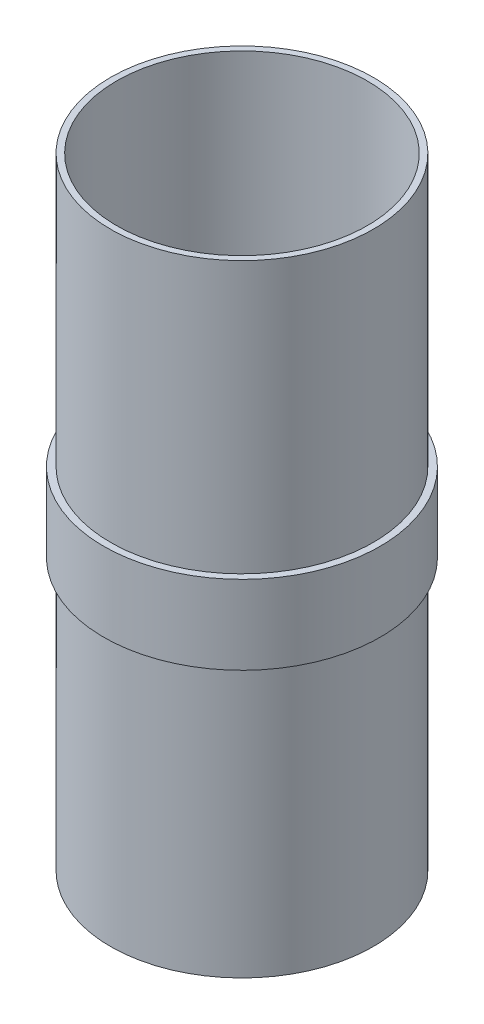
ISO-10303-21;
HEADER;
FILE_DESCRIPTION(('STEP AP214'),'2;1');
FILE_NAME('part.step','',(''),(''),'','','');
FILE_SCHEMA(('AUTOMOTIVE_DESIGN { 1 0 10303 214 1 1 1 1 }'));
ENDSEC;
DATA;
#1=APPLICATION_CONTEXT('core data for automotive mechanical design processes');
#2=APPLICATION_PROTOCOL_DEFINITION('international standard','automotive_design',2000,#1);
#3=PRODUCT_CONTEXT('',#1,'mechanical');
#4=PRODUCT('Part','Part','',(#3));
#5=PRODUCT_RELATED_PRODUCT_CATEGORY('part','',(#4));
#6=PRODUCT_DEFINITION_FORMATION('','',#4);
#7=PRODUCT_DEFINITION_CONTEXT('part definition',#1,'design');
#8=PRODUCT_DEFINITION('design','',#6,#7);
#9=PRODUCT_DEFINITION_SHAPE('','',#8);
#10=(LENGTH_UNIT() NAMED_UNIT(*) SI_UNIT(.MILLI.,.METRE.));
#11=(NAMED_UNIT(*) PLANE_ANGLE_UNIT() SI_UNIT($,.RADIAN.));
#12=(NAMED_UNIT(*) SI_UNIT($,.STERADIAN.) SOLID_ANGLE_UNIT());
#13=UNCERTAINTY_MEASURE_WITH_UNIT(LENGTH_MEASURE(1.E-05),#10,'distance_accuracy_value','');
#14=(GEOMETRIC_REPRESENTATION_CONTEXT(3) GLOBAL_UNCERTAINTY_ASSIGNED_CONTEXT((#13)) GLOBAL_UNIT_ASSIGNED_CONTEXT((#10,
#11,#12)) REPRESENTATION_CONTEXT('',''));
#15=CARTESIAN_POINT('',(0.,0.,0.));
#16=DIRECTION('',(0.,0.,1.));
#17=DIRECTION('',(1.,0.,0.));
#18=AXIS2_PLACEMENT_3D('',#15,#16,#17);
#19=CARTESIAN_POINT('',(-2.28599999999997,0.,0.));
#20=DIRECTION('',(0.,-1.,0.));
#21=DIRECTION('',(1.,0.,0.));
#22=AXIS2_PLACEMENT_3D('',#19,#20,#21);
#23=PLANE('',#22);
#24=CARTESIAN_POINT('',(47.1043,0.,0.));
#25=DIRECTION('',(0.,1.,0.));
#26=DIRECTION('',(-1.,0.,0.));
#27=AXIS2_PLACEMENT_3D('',#24,#25,#26);
#28=CIRCLE('',#27,47.1043);
#29=CARTESIAN_POINT('',(0.,0.,0.));
#30=VERTEX_POINT('',#29);
#31=EDGE_CURVE('E10',#30,#30,#28,.T.);
#32=ORIENTED_EDGE('',*,*,#31,.T.);
#33=EDGE_LOOP('',(#32));
#34=FACE_BOUND('',#33,.T.);
#35=CARTESIAN_POINT('',(47.1043,0.,0.));
#36=DIRECTION('',(0.,1.,0.));
#37=DIRECTION('',(-1.,0.,0.));
#38=AXIS2_PLACEMENT_3D('',#35,#36,#37);
#39=CIRCLE('',#38,49.3903);
#40=CARTESIAN_POINT('',(-2.28599999999998,0.,0.));
#41=VERTEX_POINT('',#40);
#42=EDGE_CURVE('E69',#41,#41,#39,.T.);
#43=ORIENTED_EDGE('',*,*,#42,.F.);
#44=EDGE_LOOP('',(#43));
#45=FACE_BOUND('',#44,.T.);
#46=ADVANCED_FACE('F41',(#34,#45),#23,.T.);
#47=CARTESIAN_POINT('',(47.1043,199.644,0.));
#48=DIRECTION('',(0.,1.,0.));
#49=DIRECTION('',(-1.,0.,0.));
#50=AXIS2_PLACEMENT_3D('',#47,#48,#49);
#51=CYLINDRICAL_SURFACE('',#50,47.1043);
#52=CARTESIAN_POINT('',(47.1043,233.3625,0.));
#53=DIRECTION('',(0.,1.,0.));
#54=DIRECTION('',(-1.,0.,0.));
#55=AXIS2_PLACEMENT_3D('',#52,#53,#54);
#56=CIRCLE('',#55,47.1043);
#57=CARTESIAN_POINT('',(0.,233.3625,0.));
#58=VERTEX_POINT('',#57);
#59=EDGE_CURVE('E47',#58,#58,#56,.T.);
#60=ORIENTED_EDGE('',*,*,#59,.T.);
#61=EDGE_LOOP('',(#60));
#62=FACE_BOUND('',#61,.T.);
#63=ORIENTED_EDGE('',*,*,#31,.F.);
#64=EDGE_LOOP('',(#63));
#65=FACE_BOUND('',#64,.T.);
#66=ADVANCED_FACE('F77',(#62,#65),#51,.F.);
#67=CARTESIAN_POINT('',(0.,233.3625,0.));
#68=DIRECTION('',(0.,1.,0.));
#69=DIRECTION('',(-1.,0.,0.));
#70=AXIS2_PLACEMENT_3D('',#67,#68,#69);
#71=PLANE('',#70);
#72=CARTESIAN_POINT('',(47.1043,233.3625,0.));
#73=DIRECTION('',(0.,1.,0.));
#74=DIRECTION('',(-1.,0.,0.));
#75=AXIS2_PLACEMENT_3D('',#72,#73,#74);
#76=CIRCLE('',#75,49.3903);
#77=CARTESIAN_POINT('',(-2.286,233.3625,0.));
#78=VERTEX_POINT('',#77);
#79=EDGE_CURVE('E51',#78,#78,#76,.T.);
#80=ORIENTED_EDGE('',*,*,#79,.T.);
#81=EDGE_LOOP('',(#80));
#82=FACE_BOUND('',#81,.T.);
#83=ORIENTED_EDGE('',*,*,#59,.F.);
#84=EDGE_LOOP('',(#83));
#85=FACE_BOUND('',#84,.T.);
#86=ADVANCED_FACE('F81',(#82,#85),#71,.T.);
#87=CARTESIAN_POINT('',(47.1043,199.644,0.));
#88=DIRECTION('',(0.,1.,0.));
#89=DIRECTION('',(-1.,0.,0.));
#90=AXIS2_PLACEMENT_3D('',#87,#88,#89);
#91=CYLINDRICAL_SURFACE('',#90,49.3903);
#92=CARTESIAN_POINT('',(47.1043,131.47675,0.));
#93=DIRECTION('',(0.,1.,0.));
#94=DIRECTION('',(-1.,0.,0.));
#95=AXIS2_PLACEMENT_3D('',#92,#93,#94);
#96=CIRCLE('',#95,49.3903);
#97=CARTESIAN_POINT('',(-2.28599999999999,131.47675,0.));
#98=VERTEX_POINT('',#97);
#99=EDGE_CURVE('E55',#98,#98,#96,.T.);
#100=ORIENTED_EDGE('',*,*,#99,.T.);
#101=EDGE_LOOP('',(#100));
#102=FACE_BOUND('',#101,.T.);
#103=ORIENTED_EDGE('',*,*,#79,.F.);
#104=EDGE_LOOP('',(#103));
#105=FACE_BOUND('',#104,.T.);
#106=ADVANCED_FACE('F85',(#102,#105),#91,.T.);
#107=CARTESIAN_POINT('',(-2.28599999999999,131.47675,0.));
#108=DIRECTION('',(0.,1.,0.));
#109=DIRECTION('',(-1.,0.,0.));
#110=AXIS2_PLACEMENT_3D('',#107,#108,#109);
#111=PLANE('',#110);
#112=CARTESIAN_POINT('',(47.1043,131.47675,0.));
#113=DIRECTION('',(0.,1.,0.));
#114=DIRECTION('',(-1.,0.,0.));
#115=AXIS2_PLACEMENT_3D('',#112,#113,#114);
#116=CIRCLE('',#115,51.9303);
#117=CARTESIAN_POINT('',(-4.82599999999999,131.47675,0.));
#118=VERTEX_POINT('',#117);
#119=EDGE_CURVE('E60',#118,#118,#116,.T.);
#120=ORIENTED_EDGE('',*,*,#119,.T.);
#121=EDGE_LOOP('',(#120));
#122=FACE_BOUND('',#121,.T.);
#123=ORIENTED_EDGE('',*,*,#99,.F.);
#124=EDGE_LOOP('',(#123));
#125=FACE_BOUND('',#124,.T.);
#126=ADVANCED_FACE('F92',(#122,#125),#111,.T.);
#127=CARTESIAN_POINT('',(47.1043,199.644,0.));
#128=DIRECTION('',(0.,1.,0.));
#129=DIRECTION('',(-1.,0.,0.));
#130=AXIS2_PLACEMENT_3D('',#127,#128,#129);
#131=CYLINDRICAL_SURFACE('',#130,51.9303);
#132=CARTESIAN_POINT('',(47.1043,101.88575,0.));
#133=DIRECTION('',(0.,1.,0.));
#134=DIRECTION('',(-1.,0.,0.));
#135=AXIS2_PLACEMENT_3D('',#132,#133,#134);
#136=CIRCLE('',#135,51.9303);
#137=CARTESIAN_POINT('',(-4.82599999999999,101.88575,0.));
#138=VERTEX_POINT('',#137);
#139=EDGE_CURVE('E63',#138,#138,#136,.T.);
#140=ORIENTED_EDGE('',*,*,#139,.T.);
#141=EDGE_LOOP('',(#140));
#142=FACE_BOUND('',#141,.T.);
#143=ORIENTED_EDGE('',*,*,#119,.F.);
#144=EDGE_LOOP('',(#143));
#145=FACE_BOUND('',#144,.T.);
#146=ADVANCED_FACE('F96',(#142,#145),#131,.T.);
#147=CARTESIAN_POINT('',(-4.82599999999999,101.88575,0.));
#148=DIRECTION('',(0.,-1.,0.));
#149=DIRECTION('',(1.,0.,0.));
#150=AXIS2_PLACEMENT_3D('',#147,#148,#149);
#151=PLANE('',#150);
#152=CARTESIAN_POINT('',(47.1043,101.88575,0.));
#153=DIRECTION('',(0.,1.,0.));
#154=DIRECTION('',(-1.,0.,0.));
#155=AXIS2_PLACEMENT_3D('',#152,#153,#154);
#156=CIRCLE('',#155,49.3903);
#157=CARTESIAN_POINT('',(-2.28599999999999,101.88575,0.));
#158=VERTEX_POINT('',#157);
#159=EDGE_CURVE('E66',#158,#158,#156,.T.);
#160=ORIENTED_EDGE('',*,*,#159,.T.);
#161=EDGE_LOOP('',(#160));
#162=FACE_BOUND('',#161,.T.);
#163=ORIENTED_EDGE('',*,*,#139,.F.);
#164=EDGE_LOOP('',(#163));
#165=FACE_BOUND('',#164,.T.);
#166=ADVANCED_FACE('F100',(#162,#165),#151,.T.);
#167=CARTESIAN_POINT('',(47.1043,199.644,0.));
#168=DIRECTION('',(0.,1.,0.));
#169=DIRECTION('',(-1.,0.,0.));
#170=AXIS2_PLACEMENT_3D('',#167,#168,#169);
#171=CYLINDRICAL_SURFACE('',#170,49.3903);
#172=ORIENTED_EDGE('',*,*,#42,.T.);
#173=EDGE_LOOP('',(#172));
#174=FACE_BOUND('',#173,.T.);
#175=ORIENTED_EDGE('',*,*,#159,.F.);
#176=EDGE_LOOP('',(#175));
#177=FACE_BOUND('',#176,.T.);
#178=ADVANCED_FACE('F73',(#174,#177),#171,.T.);
#179=CLOSED_SHELL('',(#46,#66,#86,#106,#126,#146,#166,#178));
#180=MANIFOLD_SOLID_BREP('B2',#179);
#181=ADVANCED_BREP_SHAPE_REPRESENTATION('',(#18,#180),#14);
#182=SHAPE_DEFINITION_REPRESENTATION(#9,#181);
ENDSEC;
END-ISO-10303-21;
